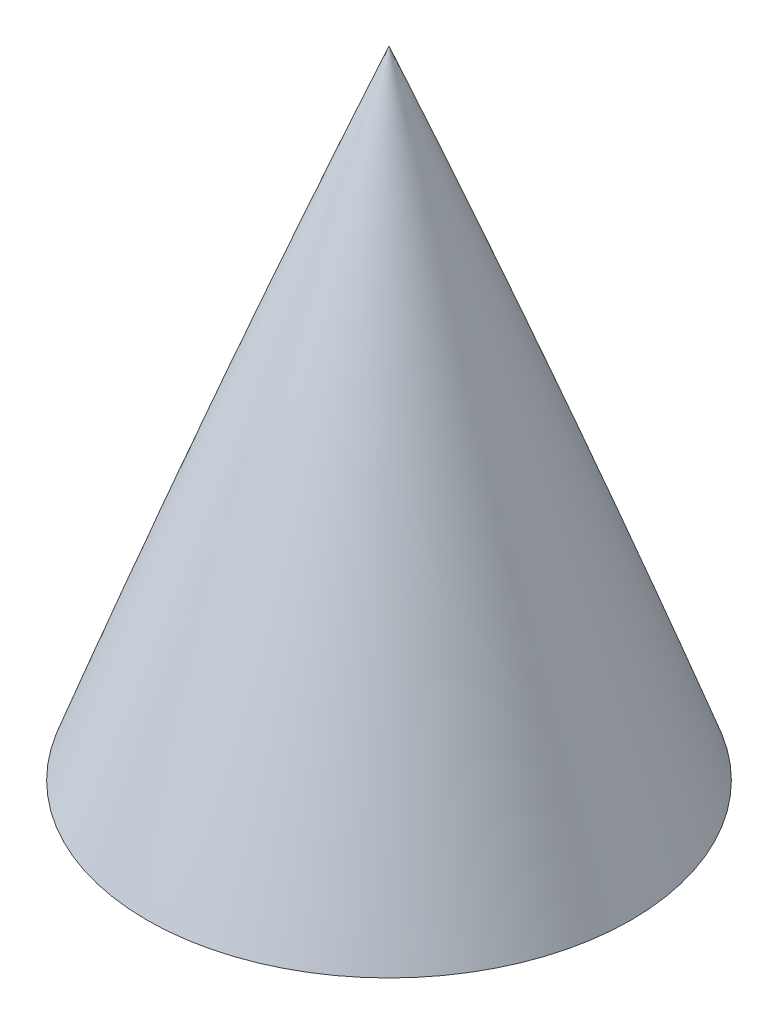
ISO-10303-21;
HEADER;
FILE_DESCRIPTION(('STEP AP214'),'2;1');
FILE_NAME('part.step','',(''),(''),'','','');
FILE_SCHEMA(('AUTOMOTIVE_DESIGN { 1 0 10303 214 1 1 1 1 }'));
ENDSEC;
DATA;
#1=APPLICATION_CONTEXT('core data for automotive mechanical design processes');
#2=APPLICATION_PROTOCOL_DEFINITION('international standard','automotive_design',2000,#1);
#3=PRODUCT_CONTEXT('',#1,'mechanical');
#4=PRODUCT('Part','Part','',(#3));
#5=PRODUCT_RELATED_PRODUCT_CATEGORY('part','',(#4));
#6=PRODUCT_DEFINITION_FORMATION('','',#4);
#7=PRODUCT_DEFINITION_CONTEXT('part definition',#1,'design');
#8=PRODUCT_DEFINITION('design','',#6,#7);
#9=PRODUCT_DEFINITION_SHAPE('','',#8);
#10=(LENGTH_UNIT() NAMED_UNIT(*) SI_UNIT(.MILLI.,.METRE.));
#11=(NAMED_UNIT(*) PLANE_ANGLE_UNIT() SI_UNIT($,.RADIAN.));
#12=(NAMED_UNIT(*) SI_UNIT($,.STERADIAN.) SOLID_ANGLE_UNIT());
#13=UNCERTAINTY_MEASURE_WITH_UNIT(LENGTH_MEASURE(1.E-05),#10,'distance_accuracy_value','');
#14=(GEOMETRIC_REPRESENTATION_CONTEXT(3) GLOBAL_UNCERTAINTY_ASSIGNED_CONTEXT((#13)) GLOBAL_UNIT_ASSIGNED_CONTEXT((#10,
#11,#12)) REPRESENTATION_CONTEXT('',''));
#15=CARTESIAN_POINT('',(0.,0.,0.));
#16=DIRECTION('',(0.,0.,1.));
#17=DIRECTION('',(1.,0.,0.));
#18=AXIS2_PLACEMENT_3D('',#15,#16,#17);
#19=CARTESIAN_POINT('',(0.,-77.7824394206777,-1014.39057082294));
#20=DIRECTION('',(-1.,0.,0.));
#21=DIRECTION('',(0.,0.,1.));
#22=AXIS2_PLACEMENT_3D('',#19,#20,#21);
#23=CIRCLE('',#22,1093.36082838655);
#24=TRIMMED_CURVE('',#23,(PARAMETER_VALUE(-0.382396865855883)),
(PARAMETER_VALUE(0.382396865855883)),.T.,.PARAMETER.);
#25=CARTESIAN_POINT('',(0.,-77.7824394206777,0.));
#26=DIRECTION('',(0.,1.,0.));
#27=AXIS1_PLACEMENT('',#25,#26);
#28=SURFACE_OF_REVOLUTION('',#24,#27);
#29=CARTESIAN_POINT('',(0.,330.2,0.));
#30=VERTEX_POINT('',#29);
#31=VERTEX_LOOP('',#30);
#32=FACE_BOUND('',#31,.T.);
#33=CARTESIAN_POINT('',(6.3416548369629E-13,292.1,0.));
#34=DIRECTION('',(0.,-1.,0.));
#35=DIRECTION('',(1.,0.,0.));
#36=AXIS2_PLACEMENT_3D('',#33,#34,#35);
#37=CIRCLE('',#36,14.5044102408933);
#38=CARTESIAN_POINT('',(14.504410240894,292.1,0.));
#39=VERTEX_POINT('',#38);
#40=EDGE_CURVE('E11',#39,#39,#37,.F.);
#41=ORIENTED_EDGE('',*,*,#40,.T.);
#42=EDGE_LOOP('',(#41));
#43=FACE_BOUND('',#42,.T.);
#44=ADVANCED_FACE('F41',(#32,#43),#28,.T.);
#45=CARTESIAN_POINT('',(-188.314971497888,292.1,83.0177250007011));
#46=DIRECTION('',(0.,-1.,0.));
#47=DIRECTION('',(1.,0.,0.));
#48=AXIS2_PLACEMENT_3D('',#45,#46,#47);
#49=PLANE('',#48);
#50=CARTESIAN_POINT('',(5.00807062043321E-13,292.1,0.));
#51=DIRECTION('',(0.,-1.,0.));
#52=DIRECTION('',(1.,0.,0.));
#53=AXIS2_PLACEMENT_3D('',#50,#51,#52);
#54=CIRCLE('',#53,2.413);
#55=CARTESIAN_POINT('',(2.4130000000005,292.1,0.));
#56=VERTEX_POINT('',#55);
#57=EDGE_CURVE('E74',#56,#56,#54,.T.);
#58=ORIENTED_EDGE('',*,*,#57,.F.);
#59=EDGE_LOOP('',(#58));
#60=FACE_BOUND('',#59,.T.);
#61=ORIENTED_EDGE('',*,*,#40,.F.);
#62=EDGE_LOOP('',(#61));
#63=FACE_BOUND('',#62,.T.);
#64=ADVANCED_FACE('F53',(#60,#63),#49,.T.);
#65=CARTESIAN_POINT('',(5.22581282132161E-13,304.8,0.));
#66=DIRECTION('',(0.,-1.,0.));
#67=DIRECTION('',(1.,0.,0.));
#68=AXIS2_PLACEMENT_3D('',#65,#66,#67);
#69=CYLINDRICAL_SURFACE('',#68,2.413);
#70=CARTESIAN_POINT('',(5.22581282132161E-13,304.8,0.));
#71=DIRECTION('',(0.,-1.,0.));
#72=DIRECTION('',(1.,0.,0.));
#73=AXIS2_PLACEMENT_3D('',#70,#71,#72);
#74=CIRCLE('',#73,2.413);
#75=CARTESIAN_POINT('',(2.41300000000052,304.8,0.));
#76=VERTEX_POINT('',#75);
#77=EDGE_CURVE('E48',#76,#76,#74,.T.);
#78=ORIENTED_EDGE('',*,*,#77,.F.);
#79=EDGE_LOOP('',(#78));
#80=FACE_BOUND('',#79,.T.);
#81=ORIENTED_EDGE('',*,*,#57,.T.);
#82=EDGE_LOOP('',(#81));
#83=FACE_BOUND('',#82,.T.);
#84=ADVANCED_FACE('F57',(#80,#83),#69,.F.);
#85=CARTESIAN_POINT('',(5.22581282132161E-13,304.8,0.));
#86=DIRECTION('',(0.,-1.,0.));
#87=DIRECTION('',(1.,0.,0.));
#88=AXIS2_PLACEMENT_3D('',#85,#86,#87);
#89=PLANE('',#88);
#90=ORIENTED_EDGE('',*,*,#77,.T.);
#91=EDGE_LOOP('',(#90));
#92=FACE_BOUND('',#91,.T.);
#93=ADVANCED_FACE('F62',(#92),#89,.T.);
#94=CLOSED_SHELL('',(#44,#64,#84,#93));
#95=MANIFOLD_SOLID_BREP('B2',#94);
#96=ADVANCED_BREP_SHAPE_REPRESENTATION('',(#18,#95),#14);
#97=SHAPE_DEFINITION_REPRESENTATION(#9,#96);
ENDSEC;
END-ISO-10303-21;
